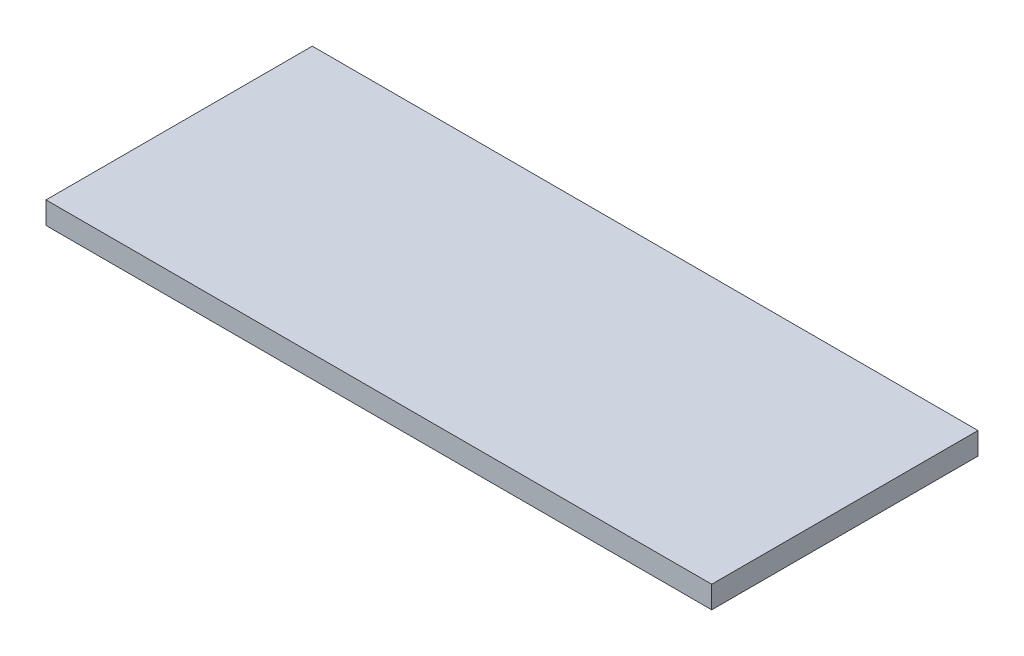
ISO-10303-21;
HEADER;
FILE_DESCRIPTION(('STEP AP214'),'2;1');
FILE_NAME('part.step','',(''),(''),'','','');
FILE_SCHEMA(('AUTOMOTIVE_DESIGN { 1 0 10303 214 1 1 1 1 }'));
ENDSEC;
DATA;
#1=APPLICATION_CONTEXT('core data for automotive mechanical design processes');
#2=APPLICATION_PROTOCOL_DEFINITION('international standard','automotive_design',2000,#1);
#3=PRODUCT_CONTEXT('',#1,'mechanical');
#4=PRODUCT('Part','Part','',(#3));
#5=PRODUCT_RELATED_PRODUCT_CATEGORY('part','',(#4));
#6=PRODUCT_DEFINITION_FORMATION('','',#4);
#7=PRODUCT_DEFINITION_CONTEXT('part definition',#1,'design');
#8=PRODUCT_DEFINITION('design','',#6,#7);
#9=PRODUCT_DEFINITION_SHAPE('','',#8);
#10=(LENGTH_UNIT() NAMED_UNIT(*) SI_UNIT(.MILLI.,.METRE.));
#11=(NAMED_UNIT(*) PLANE_ANGLE_UNIT() SI_UNIT($,.RADIAN.));
#12=(NAMED_UNIT(*) SI_UNIT($,.STERADIAN.) SOLID_ANGLE_UNIT());
#13=UNCERTAINTY_MEASURE_WITH_UNIT(LENGTH_MEASURE(1.E-05),#10,'distance_accuracy_value','');
#14=(GEOMETRIC_REPRESENTATION_CONTEXT(3) GLOBAL_UNCERTAINTY_ASSIGNED_CONTEXT((#13)) GLOBAL_UNIT_ASSIGNED_CONTEXT((#10,
#11,#12)) REPRESENTATION_CONTEXT('',''));
#15=CARTESIAN_POINT('',(0.,0.,0.));
#16=DIRECTION('',(0.,0.,1.));
#17=DIRECTION('',(1.,0.,0.));
#18=AXIS2_PLACEMENT_3D('',#15,#16,#17);
#19=CARTESIAN_POINT('',(1500.,100.,600.));
#20=DIRECTION('',(-1.,0.,0.));
#21=DIRECTION('',(0.,0.,1.));
#22=AXIS2_PLACEMENT_3D('',#19,#20,#21);
#23=PLANE('',#22);
#24=DIRECTION('',(0.,0.,-1.));
#25=VECTOR('',#24,1.);
#26=CARTESIAN_POINT('',(1500.,0.,600.));
#27=LINE('',#26,#25);
#28=CARTESIAN_POINT('',(1500.,0.,600.));
#29=VERTEX_POINT('',#28);
#30=CARTESIAN_POINT('',(1500.,0.,-600.));
#31=VERTEX_POINT('',#30);
#32=EDGE_CURVE('E109',#29,#31,#27,.T.);
#33=ORIENTED_EDGE('',*,*,#32,.T.);
#34=DIRECTION('',(0.,-1.,0.));
#35=VECTOR('',#34,1.);
#36=CARTESIAN_POINT('',(1500.,100.,-600.));
#37=LINE('',#36,#35);
#38=CARTESIAN_POINT('',(1500.,100.,-600.));
#39=VERTEX_POINT('',#38);
#40=EDGE_CURVE('E11',#39,#31,#37,.T.);
#41=ORIENTED_EDGE('',*,*,#40,.F.);
#42=DIRECTION('',(0.,0.,-1.));
#43=VECTOR('',#42,1.);
#44=CARTESIAN_POINT('',(1500.,100.,600.));
#45=LINE('',#44,#43);
#46=CARTESIAN_POINT('',(1500.,100.,600.));
#47=VERTEX_POINT('',#46);
#48=EDGE_CURVE('E93',#47,#39,#45,.T.);
#49=ORIENTED_EDGE('',*,*,#48,.F.);
#50=DIRECTION('',(0.,-1.,0.));
#51=VECTOR('',#50,1.);
#52=CARTESIAN_POINT('',(1500.,100.,600.));
#53=LINE('',#52,#51);
#54=EDGE_CURVE('E105',#47,#29,#53,.T.);
#55=ORIENTED_EDGE('',*,*,#54,.T.);
#56=EDGE_LOOP('',(#33,#41,#49,#55));
#57=FACE_BOUND('',#56,.T.);
#58=ADVANCED_FACE('F41',(#57),#23,.F.);
#59=CARTESIAN_POINT('',(-1500.,100.,-600.));
#60=DIRECTION('',(0.,0.,1.));
#61=DIRECTION('',(1.,0.,0.));
#62=AXIS2_PLACEMENT_3D('',#59,#60,#61);
#63=PLANE('',#62);
#64=DIRECTION('',(-1.,0.,0.));
#65=VECTOR('',#64,1.);
#66=CARTESIAN_POINT('',(-1500.,0.,-600.));
#67=LINE('',#66,#65);
#68=CARTESIAN_POINT('',(-1500.,0.,-600.));
#69=VERTEX_POINT('',#68);
#70=EDGE_CURVE('E98',#31,#69,#67,.T.);
#71=ORIENTED_EDGE('',*,*,#70,.T.);
#72=DIRECTION('',(0.,-1.,0.));
#73=VECTOR('',#72,1.);
#74=CARTESIAN_POINT('',(-1500.,100.,-600.));
#75=LINE('',#74,#73);
#76=CARTESIAN_POINT('',(-1500.,100.,-600.));
#77=VERTEX_POINT('',#76);
#78=EDGE_CURVE('E50',#77,#69,#75,.T.);
#79=ORIENTED_EDGE('',*,*,#78,.F.);
#80=DIRECTION('',(-1.,0.,0.));
#81=VECTOR('',#80,1.);
#82=CARTESIAN_POINT('',(-1500.,100.,-600.));
#83=LINE('',#82,#81);
#84=EDGE_CURVE('E88',#39,#77,#83,.T.);
#85=ORIENTED_EDGE('',*,*,#84,.F.);
#86=ORIENTED_EDGE('',*,*,#40,.T.);
#87=EDGE_LOOP('',(#71,#79,#85,#86));
#88=FACE_BOUND('',#87,.T.);
#89=ADVANCED_FACE('F97',(#88),#63,.F.);
#90=CARTESIAN_POINT('',(-1500.,100.,600.));
#91=DIRECTION('',(1.,0.,0.));
#92=DIRECTION('',(0.,0.,-1.));
#93=AXIS2_PLACEMENT_3D('',#90,#91,#92);
#94=PLANE('',#93);
#95=DIRECTION('',(0.,0.,1.));
#96=VECTOR('',#95,1.);
#97=CARTESIAN_POINT('',(-1500.,0.,600.));
#98=LINE('',#97,#96);
#99=CARTESIAN_POINT('',(-1500.,0.,600.));
#100=VERTEX_POINT('',#99);
#101=EDGE_CURVE('E75',#69,#100,#98,.T.);
#102=ORIENTED_EDGE('',*,*,#101,.T.);
#103=DIRECTION('',(0.,-1.,0.));
#104=VECTOR('',#103,1.);
#105=CARTESIAN_POINT('',(-1500.,100.,600.));
#106=LINE('',#105,#104);
#107=CARTESIAN_POINT('',(-1500.,100.,600.));
#108=VERTEX_POINT('',#107);
#109=EDGE_CURVE('E100',#108,#100,#106,.T.);
#110=ORIENTED_EDGE('',*,*,#109,.F.);
#111=DIRECTION('',(0.,0.,1.));
#112=VECTOR('',#111,1.);
#113=CARTESIAN_POINT('',(-1500.,100.,600.));
#114=LINE('',#113,#112);
#115=EDGE_CURVE('E91',#77,#108,#114,.T.);
#116=ORIENTED_EDGE('',*,*,#115,.F.);
#117=ORIENTED_EDGE('',*,*,#78,.T.);
#118=EDGE_LOOP('',(#102,#110,#116,#117));
#119=FACE_BOUND('',#118,.T.);
#120=ADVANCED_FACE('F101',(#119),#94,.F.);
#121=CARTESIAN_POINT('',(-1500.,100.,600.));
#122=DIRECTION('',(0.,0.,-1.));
#123=DIRECTION('',(-1.,0.,0.));
#124=AXIS2_PLACEMENT_3D('',#121,#122,#123);
#125=PLANE('',#124);
#126=DIRECTION('',(1.,0.,0.));
#127=VECTOR('',#126,1.);
#128=CARTESIAN_POINT('',(-1500.,0.,600.));
#129=LINE('',#128,#127);
#130=EDGE_CURVE('E81',#100,#29,#129,.T.);
#131=ORIENTED_EDGE('',*,*,#130,.T.);
#132=ORIENTED_EDGE('',*,*,#54,.F.);
#133=DIRECTION('',(1.,0.,0.));
#134=VECTOR('',#133,1.);
#135=CARTESIAN_POINT('',(-1500.,100.,600.));
#136=LINE('',#135,#134);
#137=EDGE_CURVE('E58',#108,#47,#136,.T.);
#138=ORIENTED_EDGE('',*,*,#137,.F.);
#139=ORIENTED_EDGE('',*,*,#109,.T.);
#140=EDGE_LOOP('',(#131,#132,#138,#139));
#141=FACE_BOUND('',#140,.T.);
#142=ADVANCED_FACE('F122',(#141),#125,.F.);
#143=CARTESIAN_POINT('',(0.,100.,0.));
#144=DIRECTION('',(0.,-1.,0.));
#145=DIRECTION('',(0.,0.,-1.));
#146=AXIS2_PLACEMENT_3D('',#143,#144,#145);
#147=PLANE('',#146);
#148=ORIENTED_EDGE('',*,*,#48,.T.);
#149=ORIENTED_EDGE('',*,*,#84,.T.);
#150=ORIENTED_EDGE('',*,*,#115,.T.);
#151=ORIENTED_EDGE('',*,*,#137,.T.);
#152=EDGE_LOOP('',(#148,#149,#150,#151));
#153=FACE_BOUND('',#152,.T.);
#154=ADVANCED_FACE('F89',(#153),#147,.F.);
#155=CARTESIAN_POINT('',(0.,0.,0.));
#156=DIRECTION('',(0.,-1.,0.));
#157=DIRECTION('',(0.,0.,-1.));
#158=AXIS2_PLACEMENT_3D('',#155,#156,#157);
#159=PLANE('',#158);
#160=ORIENTED_EDGE('',*,*,#32,.F.);
#161=ORIENTED_EDGE('',*,*,#130,.F.);
#162=ORIENTED_EDGE('',*,*,#101,.F.);
#163=ORIENTED_EDGE('',*,*,#70,.F.);
#164=EDGE_LOOP('',(#160,#161,#162,#163));
#165=FACE_BOUND('',#164,.T.);
#166=ADVANCED_FACE('F125',(#165),#159,.T.);
#167=CLOSED_SHELL('',(#58,#89,#120,#142,#154,#166));
#168=MANIFOLD_SOLID_BREP('B2',#167);
#169=ADVANCED_BREP_SHAPE_REPRESENTATION('',(#18,#168),#14);
#170=SHAPE_DEFINITION_REPRESENTATION(#9,#169);
ENDSEC;
END-ISO-10303-21;
